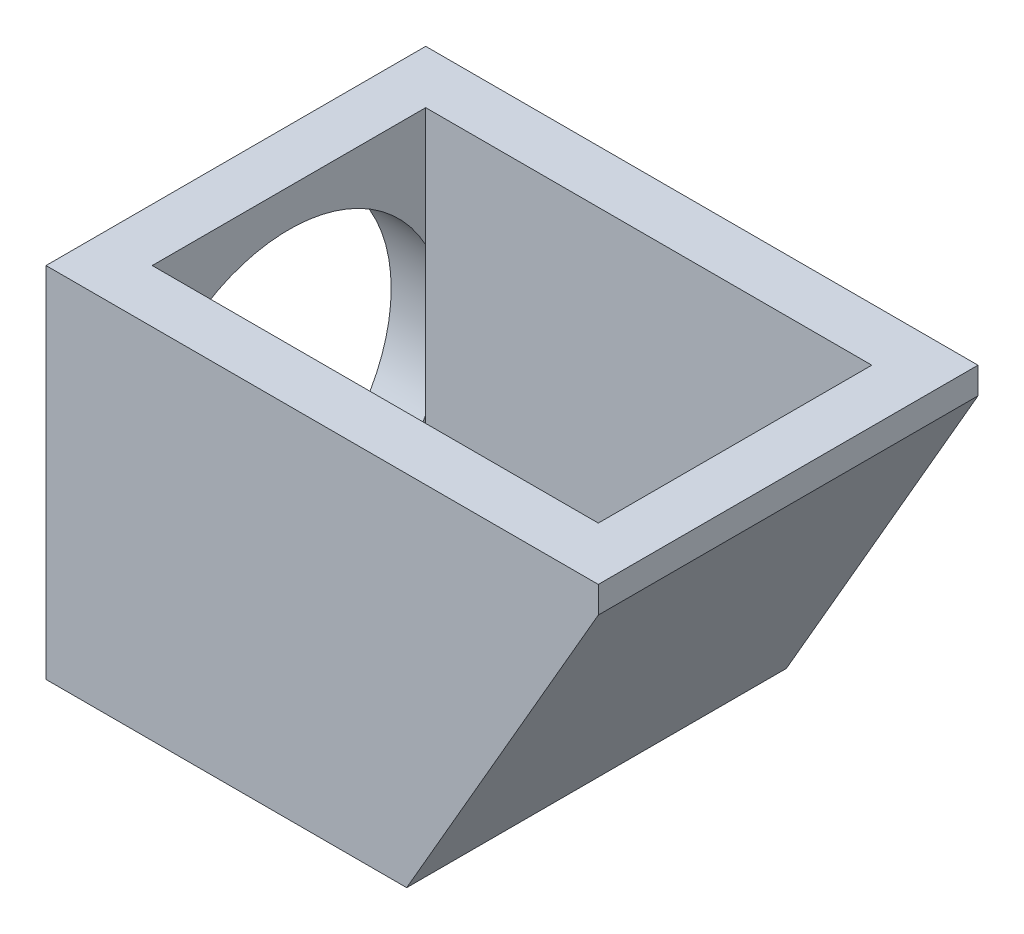
ISO-10303-21;
HEADER;
FILE_DESCRIPTION(('STEP AP214'),'2;1');
FILE_NAME('part.step','',(''),(''),'','','');
FILE_SCHEMA(('AUTOMOTIVE_DESIGN { 1 0 10303 214 1 1 1 1 }'));
ENDSEC;
DATA;
#1=APPLICATION_CONTEXT('core data for automotive mechanical design processes');
#2=APPLICATION_PROTOCOL_DEFINITION('international standard','automotive_design',2000,#1);
#3=PRODUCT_CONTEXT('',#1,'mechanical');
#4=PRODUCT('Part','Part','',(#3));
#5=PRODUCT_RELATED_PRODUCT_CATEGORY('part','',(#4));
#6=PRODUCT_DEFINITION_FORMATION('','',#4);
#7=PRODUCT_DEFINITION_CONTEXT('part definition',#1,'design');
#8=PRODUCT_DEFINITION('design','',#6,#7);
#9=PRODUCT_DEFINITION_SHAPE('','',#8);
#10=(LENGTH_UNIT() NAMED_UNIT(*) SI_UNIT(.MILLI.,.METRE.));
#11=(NAMED_UNIT(*) PLANE_ANGLE_UNIT() SI_UNIT($,.RADIAN.));
#12=(NAMED_UNIT(*) SI_UNIT($,.STERADIAN.) SOLID_ANGLE_UNIT());
#13=UNCERTAINTY_MEASURE_WITH_UNIT(LENGTH_MEASURE(1.E-05),#10,'distance_accuracy_value','');
#14=(GEOMETRIC_REPRESENTATION_CONTEXT(3) GLOBAL_UNCERTAINTY_ASSIGNED_CONTEXT((#13)) GLOBAL_UNIT_ASSIGNED_CONTEXT((#10,
#11,#12)) REPRESENTATION_CONTEXT('',''));
#15=CARTESIAN_POINT('',(0.,0.,0.));
#16=DIRECTION('',(0.,0.,1.));
#17=DIRECTION('',(1.,0.,0.));
#18=AXIS2_PLACEMENT_3D('',#15,#16,#17);
#19=CARTESIAN_POINT('',(8.4,12.5,-5.15));
#20=DIRECTION('',(-1.,0.,0.));
#21=DIRECTION('',(0.,0.,1.));
#22=AXIS2_PLACEMENT_3D('',#19,#20,#21);
#23=PLANE('',#22);
#24=DIRECTION('',(0.,-1.,0.));
#25=VECTOR('',#24,1.);
#26=CARTESIAN_POINT('',(8.4,12.5,-5.15));
#27=LINE('',#26,#25);
#28=CARTESIAN_POINT('',(8.4,12.5,-5.15));
#29=VERTEX_POINT('',#28);
#30=CARTESIAN_POINT('',(8.4,11.5,-5.15));
#31=VERTEX_POINT('',#30);
#32=EDGE_CURVE('E163',#29,#31,#27,.T.);
#33=ORIENTED_EDGE('',*,*,#32,.T.);
#34=DIRECTION('',(0.,0.,-1.));
#35=VECTOR('',#34,1.);
#36=CARTESIAN_POINT('',(8.4,11.5,6.));
#37=LINE('',#36,#35);
#38=CARTESIAN_POINT('',(8.4,11.5,5.15));
#39=VERTEX_POINT('',#38);
#40=EDGE_CURVE('E217',#39,#31,#37,.T.);
#41=ORIENTED_EDGE('',*,*,#40,.F.);
#42=DIRECTION('',(0.,-1.,0.));
#43=VECTOR('',#42,1.);
#44=CARTESIAN_POINT('',(8.4,12.5,5.15));
#45=LINE('',#44,#43);
#46=CARTESIAN_POINT('',(8.4,12.5,5.15));
#47=VERTEX_POINT('',#46);
#48=EDGE_CURVE('E173',#47,#39,#45,.T.);
#49=ORIENTED_EDGE('',*,*,#48,.F.);
#50=DIRECTION('',(0.,0.,-1.));
#51=VECTOR('',#50,1.);
#52=CARTESIAN_POINT('',(8.4,12.5,-5.15));
#53=LINE('',#52,#51);
#54=EDGE_CURVE('E179',#47,#29,#53,.T.);
#55=ORIENTED_EDGE('',*,*,#54,.T.);
#56=EDGE_LOOP('',(#33,#41,#49,#55));
#57=FACE_BOUND('',#56,.T.);
#58=ADVANCED_FACE('F33',(#57),#23,.T.);
#59=CARTESIAN_POINT('',(-8.4,12.5,-5.15));
#60=DIRECTION('',(0.,0.,1.));
#61=DIRECTION('',(1.,0.,0.));
#62=AXIS2_PLACEMENT_3D('',#59,#60,#61);
#63=PLANE('',#62);
#64=DIRECTION('',(-1.,0.,0.));
#65=VECTOR('',#64,1.);
#66=CARTESIAN_POINT('',(-8.4,0.,-5.15));
#67=LINE('',#66,#65);
#68=CARTESIAN_POINT('',(1.76047190431923,0.,-5.15));
#69=VERTEX_POINT('',#68);
#70=CARTESIAN_POINT('',(-8.4,0.,-5.15));
#71=VERTEX_POINT('',#70);
#72=EDGE_CURVE('E185',#69,#71,#67,.T.);
#73=ORIENTED_EDGE('',*,*,#72,.F.);
#74=DIRECTION('',(0.500000000000004,0.866025403784436,0.));
#75=VECTOR('',#74,1.);
#76=CARTESIAN_POINT('',(4.63301270189215,4.97538660821067,-5.15));
#77=LINE('',#76,#75);
#78=EDGE_CURVE('E56',#69,#31,#77,.T.);
#79=ORIENTED_EDGE('',*,*,#78,.T.);
#80=ORIENTED_EDGE('',*,*,#32,.F.);
#81=DIRECTION('',(-1.,0.,0.));
#82=VECTOR('',#81,1.);
#83=CARTESIAN_POINT('',(-8.4,12.5,-5.15));
#84=LINE('',#83,#82);
#85=CARTESIAN_POINT('',(-8.4,12.5,-5.15));
#86=VERTEX_POINT('',#85);
#87=EDGE_CURVE('E191',#29,#86,#84,.T.);
#88=ORIENTED_EDGE('',*,*,#87,.T.);
#89=DIRECTION('',(0.,-1.,0.));
#90=VECTOR('',#89,1.);
#91=CARTESIAN_POINT('',(-8.4,12.5,-5.15));
#92=LINE('',#91,#90);
#93=CARTESIAN_POINT('',(-8.4,8.02488738510232,-5.15));
#94=VERTEX_POINT('',#93);
#95=EDGE_CURVE('E165',#86,#94,#92,.T.);
#96=ORIENTED_EDGE('',*,*,#95,.T.);
#97=DIRECTION('',(0.,1.,0.));
#98=VECTOR('',#97,1.);
#99=CARTESIAN_POINT('',(-8.4,12.5,-5.15));
#100=LINE('',#99,#98);
#101=CARTESIAN_POINT('',(-8.4,2.47511261489768,-5.15));
#102=VERTEX_POINT('',#101);
#103=EDGE_CURVE('E201',#102,#94,#100,.T.);
#104=ORIENTED_EDGE('',*,*,#103,.F.);
#105=EDGE_CURVE('E168',#102,#71,#92,.T.);
#106=ORIENTED_EDGE('',*,*,#105,.T.);
#107=EDGE_LOOP('',(#73,#79,#80,#88,#96,#104,#106));
#108=FACE_BOUND('',#107,.T.);
#109=ADVANCED_FACE('F245',(#108),#63,.T.);
#110=CARTESIAN_POINT('',(-8.4,12.5,5.15));
#111=DIRECTION('',(0.,0.,-1.));
#112=DIRECTION('',(-1.,0.,0.));
#113=AXIS2_PLACEMENT_3D('',#110,#111,#112);
#114=PLANE('',#113);
#115=ORIENTED_EDGE('',*,*,#48,.T.);
#116=DIRECTION('',(-0.500000000000004,-0.866025403784436,0.));
#117=VECTOR('',#116,1.);
#118=CARTESIAN_POINT('',(4.63301270189216,4.97538660821067,5.15));
#119=LINE('',#118,#117);
#120=CARTESIAN_POINT('',(1.76047190431923,0.,5.15));
#121=VERTEX_POINT('',#120);
#122=EDGE_CURVE('E214',#39,#121,#119,.T.);
#123=ORIENTED_EDGE('',*,*,#122,.T.);
#124=DIRECTION('',(1.,0.,0.));
#125=VECTOR('',#124,1.);
#126=CARTESIAN_POINT('',(-8.4,0.,5.15));
#127=LINE('',#126,#125);
#128=CARTESIAN_POINT('',(-8.4,0.,5.15));
#129=VERTEX_POINT('',#128);
#130=EDGE_CURVE('E177',#129,#121,#127,.T.);
#131=ORIENTED_EDGE('',*,*,#130,.F.);
#132=DIRECTION('',(0.,-1.,0.));
#133=VECTOR('',#132,1.);
#134=CARTESIAN_POINT('',(-8.4,12.5,5.15));
#135=LINE('',#134,#133);
#136=CARTESIAN_POINT('',(-8.4,2.47511261489768,5.15));
#137=VERTEX_POINT('',#136);
#138=EDGE_CURVE('E172',#137,#129,#135,.T.);
#139=ORIENTED_EDGE('',*,*,#138,.F.);
#140=DIRECTION('',(0.,-1.,0.));
#141=VECTOR('',#140,1.);
#142=CARTESIAN_POINT('',(-8.4,12.5,5.15));
#143=LINE('',#142,#141);
#144=CARTESIAN_POINT('',(-8.4,8.02488738510232,5.15));
#145=VERTEX_POINT('',#144);
#146=EDGE_CURVE('E203',#145,#137,#143,.T.);
#147=ORIENTED_EDGE('',*,*,#146,.F.);
#148=CARTESIAN_POINT('',(-8.4,12.5,5.15));
#149=VERTEX_POINT('',#148);
#150=EDGE_CURVE('E169',#149,#145,#135,.T.);
#151=ORIENTED_EDGE('',*,*,#150,.F.);
#152=DIRECTION('',(1.,0.,0.));
#153=VECTOR('',#152,1.);
#154=CARTESIAN_POINT('',(-8.4,12.5,5.15));
#155=LINE('',#154,#153);
#156=EDGE_CURVE('E176',#149,#47,#155,.T.);
#157=ORIENTED_EDGE('',*,*,#156,.T.);
#158=EDGE_LOOP('',(#115,#123,#131,#139,#147,#151,#157));
#159=FACE_BOUND('',#158,.T.);
#160=ADVANCED_FACE('F251',(#159),#114,.T.);
#161=CARTESIAN_POINT('',(0.,0.,0.));
#162=DIRECTION('',(0.,-1.,0.));
#163=DIRECTION('',(0.,0.,-1.));
#164=AXIS2_PLACEMENT_3D('',#161,#162,#163);
#165=PLANE('',#164);
#166=DIRECTION('',(0.,0.,1.));
#167=VECTOR('',#166,1.);
#168=CARTESIAN_POINT('',(1.76047190431923,0.,0.));
#169=LINE('',#168,#167);
#170=EDGE_CURVE('E11',#69,#121,#169,.T.);
#171=ORIENTED_EDGE('',*,*,#170,.F.);
#172=ORIENTED_EDGE('',*,*,#72,.T.);
#173=DIRECTION('',(0.,0.,1.));
#174=VECTOR('',#173,1.);
#175=CARTESIAN_POINT('',(-8.4,0.,-5.15));
#176=LINE('',#175,#174);
#177=CARTESIAN_POINT('',(-8.4,0.,-2.58069758011279));
#178=VERTEX_POINT('',#177);
#179=EDGE_CURVE('E180',#71,#178,#176,.T.);
#180=ORIENTED_EDGE('',*,*,#179,.T.);
#181=CARTESIAN_POINT('',(-8.4,0.,2.58069758011279));
#182=VERTEX_POINT('',#181);
#183=EDGE_CURVE('E183',#178,#182,#176,.T.);
#184=ORIENTED_EDGE('',*,*,#183,.T.);
#185=EDGE_CURVE('E184',#182,#129,#176,.T.);
#186=ORIENTED_EDGE('',*,*,#185,.T.);
#187=ORIENTED_EDGE('',*,*,#130,.T.);
#188=EDGE_LOOP('',(#171,#172,#180,#184,#186,#187));
#189=FACE_BOUND('',#188,.T.);
#190=ADVANCED_FACE('F346',(#189),#165,.F.);
#191=CARTESIAN_POINT('',(-8.4,12.5,-5.15));
#192=DIRECTION('',(1.,0.,0.));
#193=DIRECTION('',(0.,0.,-1.));
#194=AXIS2_PLACEMENT_3D('',#191,#192,#193);
#195=PLANE('',#194);
#196=CARTESIAN_POINT('',(-8.4,5.25,0.));
#197=DIRECTION('',(1.,0.,0.));
#198=DIRECTION('',(0.,0.,-1.));
#199=AXIS2_PLACEMENT_3D('',#196,#197,#198);
#200=CIRCLE('',#199,5.85);
#201=EDGE_CURVE('E439',#145,#94,#200,.F.);
#202=ORIENTED_EDGE('',*,*,#201,.T.);
#203=ORIENTED_EDGE('',*,*,#95,.F.);
#204=DIRECTION('',(0.,0.,1.));
#205=VECTOR('',#204,1.);
#206=CARTESIAN_POINT('',(-8.4,12.5,-5.15));
#207=LINE('',#206,#205);
#208=EDGE_CURVE('E188',#86,#149,#207,.T.);
#209=ORIENTED_EDGE('',*,*,#208,.T.);
#210=ORIENTED_EDGE('',*,*,#150,.T.);
#211=EDGE_LOOP('',(#202,#203,#209,#210));
#212=FACE_BOUND('',#211,.T.);
#213=ADVANCED_FACE('F275',(#212),#195,.T.);
#214=EDGE_CURVE('E420',#182,#137,#200,.F.);
#215=ORIENTED_EDGE('',*,*,#214,.T.);
#216=ORIENTED_EDGE('',*,*,#138,.T.);
#217=ORIENTED_EDGE('',*,*,#185,.F.);
#218=EDGE_LOOP('',(#215,#216,#217));
#219=FACE_BOUND('',#218,.T.);
#220=ADVANCED_FACE('F241',(#219),#195,.T.);
#221=CARTESIAN_POINT('',(0.,12.5,0.));
#222=DIRECTION('',(0.,1.,0.));
#223=DIRECTION('',(0.,0.,1.));
#224=AXIS2_PLACEMENT_3D('',#221,#222,#223);
#225=PLANE('',#224);
#226=DIRECTION('',(0.,0.,1.));
#227=VECTOR('',#226,1.);
#228=CARTESIAN_POINT('',(-10.4,12.5,-7.15));
#229=LINE('',#228,#227);
#230=CARTESIAN_POINT('',(-10.4,12.5,-7.15));
#231=VERTEX_POINT('',#230);
#232=CARTESIAN_POINT('',(-10.4,12.5,7.15));
#233=VERTEX_POINT('',#232);
#234=EDGE_CURVE('E160',#231,#233,#229,.T.);
#235=ORIENTED_EDGE('',*,*,#234,.T.);
#236=DIRECTION('',(1.,0.,0.));
#237=VECTOR('',#236,1.);
#238=CARTESIAN_POINT('',(-10.4,12.5,7.15));
#239=LINE('',#238,#237);
#240=CARTESIAN_POINT('',(10.4,12.5,7.15));
#241=VERTEX_POINT('',#240);
#242=EDGE_CURVE('E158',#233,#241,#239,.T.);
#243=ORIENTED_EDGE('',*,*,#242,.T.);
#244=DIRECTION('',(0.,0.,-1.));
#245=VECTOR('',#244,1.);
#246=CARTESIAN_POINT('',(10.4,12.5,-7.15));
#247=LINE('',#246,#245);
#248=CARTESIAN_POINT('',(10.4,12.5,-7.15));
#249=VERTEX_POINT('',#248);
#250=EDGE_CURVE('E148',#241,#249,#247,.T.);
#251=ORIENTED_EDGE('',*,*,#250,.T.);
#252=DIRECTION('',(-1.,0.,0.));
#253=VECTOR('',#252,1.);
#254=CARTESIAN_POINT('',(-10.4,12.5,-7.15));
#255=LINE('',#254,#253);
#256=EDGE_CURVE('E155',#249,#231,#255,.T.);
#257=ORIENTED_EDGE('',*,*,#256,.T.);
#258=EDGE_LOOP('',(#235,#243,#251,#257));
#259=FACE_BOUND('',#258,.T.);
#260=ORIENTED_EDGE('',*,*,#87,.F.);
#261=ORIENTED_EDGE('',*,*,#54,.F.);
#262=ORIENTED_EDGE('',*,*,#156,.F.);
#263=ORIENTED_EDGE('',*,*,#208,.F.);
#264=EDGE_LOOP('',(#260,#261,#262,#263));
#265=FACE_BOUND('',#264,.T.);
#266=ADVANCED_FACE('F230',(#259,#265),#225,.T.);
#267=CARTESIAN_POINT('',(-10.4,12.5,-7.15));
#268=DIRECTION('',(1.,0.,0.));
#269=DIRECTION('',(0.,0.,-1.));
#270=AXIS2_PLACEMENT_3D('',#267,#268,#269);
#271=PLANE('',#270);
#272=CARTESIAN_POINT('',(-10.4,5.25,0.));
#273=DIRECTION('',(-1.,0.,0.));
#274=DIRECTION('',(0.,0.,1.));
#275=AXIS2_PLACEMENT_3D('',#272,#273,#274);
#276=CIRCLE('',#275,5.85);
#277=CARTESIAN_POINT('',(-10.4,5.25,5.85));
#278=VERTEX_POINT('',#277);
#279=EDGE_CURVE('E210',#278,#278,#276,.T.);
#280=ORIENTED_EDGE('',*,*,#279,.F.);
#281=EDGE_LOOP('',(#280));
#282=FACE_BOUND('',#281,.T.);
#283=DIRECTION('',(0.,-1.,0.));
#284=VECTOR('',#283,1.);
#285=CARTESIAN_POINT('',(-10.4,12.5,-7.15));
#286=LINE('',#285,#284);
#287=CARTESIAN_POINT('',(-10.4,-1.,-7.15));
#288=VERTEX_POINT('',#287);
#289=EDGE_CURVE('E151',#231,#288,#286,.T.);
#290=ORIENTED_EDGE('',*,*,#289,.T.);
#291=DIRECTION('',(0.,0.,-1.));
#292=VECTOR('',#291,1.);
#293=CARTESIAN_POINT('',(-10.4,-1.,7.15));
#294=LINE('',#293,#292);
#295=CARTESIAN_POINT('',(-10.4,-1.,7.15));
#296=VERTEX_POINT('',#295);
#297=EDGE_CURVE('E198',#296,#288,#294,.T.);
#298=ORIENTED_EDGE('',*,*,#297,.F.);
#299=DIRECTION('',(0.,-1.,0.));
#300=VECTOR('',#299,1.);
#301=CARTESIAN_POINT('',(-10.4,12.5,7.15));
#302=LINE('',#301,#300);
#303=EDGE_CURVE('E41',#233,#296,#302,.T.);
#304=ORIENTED_EDGE('',*,*,#303,.F.);
#305=ORIENTED_EDGE('',*,*,#234,.F.);
#306=EDGE_LOOP('',(#290,#298,#304,#305));
#307=FACE_BOUND('',#306,.T.);
#308=ADVANCED_FACE('F35',(#282,#307),#271,.F.);
#309=CARTESIAN_POINT('',(-10.4,12.5,7.15));
#310=DIRECTION('',(0.,0.,-1.));
#311=DIRECTION('',(-1.,0.,0.));
#312=AXIS2_PLACEMENT_3D('',#309,#310,#311);
#313=PLANE('',#312);
#314=DIRECTION('',(-1.,0.,0.));
#315=VECTOR('',#314,1.);
#316=CARTESIAN_POINT('',(-10.4,-1.,7.15));
#317=LINE('',#316,#315);
#318=CARTESIAN_POINT('',(3.1831216351296,-1.,7.15));
#319=VERTEX_POINT('',#318);
#320=EDGE_CURVE('E145',#319,#296,#317,.T.);
#321=ORIENTED_EDGE('',*,*,#320,.F.);
#322=DIRECTION('',(-0.500000000000004,-0.866025403784436,0.));
#323=VECTOR('',#322,1.);
#324=CARTESIAN_POINT('',(10.4,11.5,7.15));
#325=LINE('',#324,#323);
#326=CARTESIAN_POINT('',(10.4,11.5,7.15));
#327=VERTEX_POINT('',#326);
#328=EDGE_CURVE('E48',#327,#319,#325,.T.);
#329=ORIENTED_EDGE('',*,*,#328,.F.);
#330=DIRECTION('',(0.,-1.,0.));
#331=VECTOR('',#330,1.);
#332=CARTESIAN_POINT('',(10.4,12.5,7.15));
#333=LINE('',#332,#331);
#334=EDGE_CURVE('E142',#241,#327,#333,.T.);
#335=ORIENTED_EDGE('',*,*,#334,.F.);
#336=ORIENTED_EDGE('',*,*,#242,.F.);
#337=ORIENTED_EDGE('',*,*,#303,.T.);
#338=EDGE_LOOP('',(#321,#329,#335,#336,#337));
#339=FACE_BOUND('',#338,.T.);
#340=ADVANCED_FACE('F141',(#339),#313,.F.);
#341=CARTESIAN_POINT('',(10.4,12.5,-7.15));
#342=DIRECTION('',(-1.,0.,0.));
#343=DIRECTION('',(0.,0.,1.));
#344=AXIS2_PLACEMENT_3D('',#341,#342,#343);
#345=PLANE('',#344);
#346=ORIENTED_EDGE('',*,*,#334,.T.);
#347=DIRECTION('',(0.,0.,1.));
#348=VECTOR('',#347,1.);
#349=CARTESIAN_POINT('',(10.4,11.5,-21.5837567297407));
#350=LINE('',#349,#348);
#351=CARTESIAN_POINT('',(10.4,11.5,-7.15));
#352=VERTEX_POINT('',#351);
#353=EDGE_CURVE('E128',#352,#327,#350,.T.);
#354=ORIENTED_EDGE('',*,*,#353,.F.);
#355=DIRECTION('',(0.,-1.,0.));
#356=VECTOR('',#355,1.);
#357=CARTESIAN_POINT('',(10.4,12.5,-7.15));
#358=LINE('',#357,#356);
#359=EDGE_CURVE('E149',#249,#352,#358,.T.);
#360=ORIENTED_EDGE('',*,*,#359,.F.);
#361=ORIENTED_EDGE('',*,*,#250,.F.);
#362=EDGE_LOOP('',(#346,#354,#360,#361));
#363=FACE_BOUND('',#362,.T.);
#364=ADVANCED_FACE('F147',(#363),#345,.F.);
#365=CARTESIAN_POINT('',(-10.4,12.5,-7.15));
#366=DIRECTION('',(0.,0.,1.));
#367=DIRECTION('',(1.,0.,0.));
#368=AXIS2_PLACEMENT_3D('',#365,#366,#367);
#369=PLANE('',#368);
#370=ORIENTED_EDGE('',*,*,#359,.T.);
#371=DIRECTION('',(0.500000000000004,0.866025403784436,0.));
#372=VECTOR('',#371,1.);
#373=CARTESIAN_POINT('',(10.4,11.5,-7.15));
#374=LINE('',#373,#372);
#375=CARTESIAN_POINT('',(3.1831216351296,-1.,-7.15));
#376=VERTEX_POINT('',#375);
#377=EDGE_CURVE('E131',#376,#352,#374,.T.);
#378=ORIENTED_EDGE('',*,*,#377,.F.);
#379=DIRECTION('',(1.,0.,0.));
#380=VECTOR('',#379,1.);
#381=CARTESIAN_POINT('',(-10.4,-1.,-7.15));
#382=LINE('',#381,#380);
#383=EDGE_CURVE('E195',#288,#376,#382,.T.);
#384=ORIENTED_EDGE('',*,*,#383,.F.);
#385=ORIENTED_EDGE('',*,*,#289,.F.);
#386=ORIENTED_EDGE('',*,*,#256,.F.);
#387=EDGE_LOOP('',(#370,#378,#384,#385,#386));
#388=FACE_BOUND('',#387,.T.);
#389=ADVANCED_FACE('F225',(#388),#369,.F.);
#390=EDGE_CURVE('E205',#102,#178,#200,.F.);
#391=ORIENTED_EDGE('',*,*,#390,.T.);
#392=ORIENTED_EDGE('',*,*,#179,.F.);
#393=ORIENTED_EDGE('',*,*,#105,.F.);
#394=EDGE_LOOP('',(#391,#392,#393));
#395=FACE_BOUND('',#394,.T.);
#396=ADVANCED_FACE('F257',(#395),#195,.T.);
#397=CARTESIAN_POINT('',(0.,-1.,0.));
#398=DIRECTION('',(0.,-1.,0.));
#399=DIRECTION('',(0.,0.,-1.));
#400=AXIS2_PLACEMENT_3D('',#397,#398,#399);
#401=PLANE('',#400);
#402=DIRECTION('',(0.,0.,1.));
#403=VECTOR('',#402,1.);
#404=CARTESIAN_POINT('',(3.1831216351296,-1.,-21.5837567297407));
#405=LINE('',#404,#403);
#406=EDGE_CURVE('E136',#376,#319,#405,.T.);
#407=ORIENTED_EDGE('',*,*,#406,.T.);
#408=ORIENTED_EDGE('',*,*,#320,.T.);
#409=ORIENTED_EDGE('',*,*,#297,.T.);
#410=ORIENTED_EDGE('',*,*,#383,.T.);
#411=EDGE_LOOP('',(#407,#408,#409,#410));
#412=FACE_BOUND('',#411,.T.);
#413=ADVANCED_FACE('F222',(#412),#401,.T.);
#414=CARTESIAN_POINT('',(-8.4,12.5,-5.15));
#415=DIRECTION('',(1.,0.,0.));
#416=DIRECTION('',(0.,0.,-1.));
#417=AXIS2_PLACEMENT_3D('',#414,#415,#416);
#418=PLANE('',#417);
#419=ORIENTED_EDGE('',*,*,#103,.T.);
#420=EDGE_CURVE('E209',#94,#102,#200,.F.);
#421=ORIENTED_EDGE('',*,*,#420,.T.);
#422=EDGE_LOOP('',(#419,#421));
#423=FACE_BOUND('',#422,.T.);
#424=ADVANCED_FACE('F281',(#423),#418,.F.);
#425=EDGE_CURVE('E208',#178,#182,#200,.F.);
#426=ORIENTED_EDGE('',*,*,#425,.T.);
#427=ORIENTED_EDGE('',*,*,#183,.F.);
#428=EDGE_LOOP('',(#426,#427));
#429=FACE_BOUND('',#428,.T.);
#430=ADVANCED_FACE('F288',(#429),#418,.F.);
#431=ORIENTED_EDGE('',*,*,#146,.T.);
#432=EDGE_CURVE('E427',#137,#145,#200,.F.);
#433=ORIENTED_EDGE('',*,*,#432,.T.);
#434=EDGE_LOOP('',(#431,#433));
#435=FACE_BOUND('',#434,.T.);
#436=ADVANCED_FACE('F291',(#435),#418,.F.);
#437=CARTESIAN_POINT('',(8.14629867976521,5.25,0.));
#438=DIRECTION('',(-1.,0.,0.));
#439=DIRECTION('',(0.,0.,1.));
#440=AXIS2_PLACEMENT_3D('',#437,#438,#439);
#441=CYLINDRICAL_SURFACE('',#440,5.85);
#442=ORIENTED_EDGE('',*,*,#279,.T.);
#443=EDGE_LOOP('',(#442));
#444=FACE_BOUND('',#443,.T.);
#445=ORIENTED_EDGE('',*,*,#390,.F.);
#446=ORIENTED_EDGE('',*,*,#420,.F.);
#447=ORIENTED_EDGE('',*,*,#201,.F.);
#448=ORIENTED_EDGE('',*,*,#432,.F.);
#449=ORIENTED_EDGE('',*,*,#214,.F.);
#450=ORIENTED_EDGE('',*,*,#425,.F.);
#451=EDGE_LOOP('',(#445,#446,#447,#448,#449,#450));
#452=FACE_BOUND('',#451,.T.);
#453=ADVANCED_FACE('F303',(#444,#452),#441,.F.);
#454=CARTESIAN_POINT('',(8.4,11.5,6.));
#455=DIRECTION('',(0.866025403784436,-0.500000000000004,0.));
#456=DIRECTION('',(0.500000000000004,0.866025403784436,0.));
#457=AXIS2_PLACEMENT_3D('',#454,#455,#456);
#458=PLANE('',#457);
#459=ORIENTED_EDGE('',*,*,#78,.F.);
#460=ORIENTED_EDGE('',*,*,#170,.T.);
#461=ORIENTED_EDGE('',*,*,#122,.F.);
#462=ORIENTED_EDGE('',*,*,#40,.T.);
#463=EDGE_LOOP('',(#459,#460,#461,#462));
#464=FACE_BOUND('',#463,.T.);
#465=ADVANCED_FACE('F310',(#464),#458,.F.);
#466=CARTESIAN_POINT('',(10.4,11.5,-21.5837567297407));
#467=DIRECTION('',(-0.866025403784436,0.500000000000004,0.));
#468=DIRECTION('',(-0.500000000000004,-0.866025403784436,0.));
#469=AXIS2_PLACEMENT_3D('',#466,#467,#468);
#470=PLANE('',#469);
#471=ORIENTED_EDGE('',*,*,#377,.T.);
#472=ORIENTED_EDGE('',*,*,#353,.T.);
#473=ORIENTED_EDGE('',*,*,#328,.T.);
#474=ORIENTED_EDGE('',*,*,#406,.F.);
#475=EDGE_LOOP('',(#471,#472,#473,#474));
#476=FACE_BOUND('',#475,.T.);
#477=ADVANCED_FACE('F129',(#476),#470,.F.);
#478=CLOSED_SHELL('',(#58,#109,#160,#190,#213,#220,#266,#308,#340,#364,#389,#396,#413,#424,#430,
#436,#453,#465,#477));
#479=MANIFOLD_SOLID_BREP('B2',#478);
#480=ADVANCED_BREP_SHAPE_REPRESENTATION('',(#18,#479),#14);
#481=SHAPE_DEFINITION_REPRESENTATION(#9,#480);
ENDSEC;
END-ISO-10303-21;
